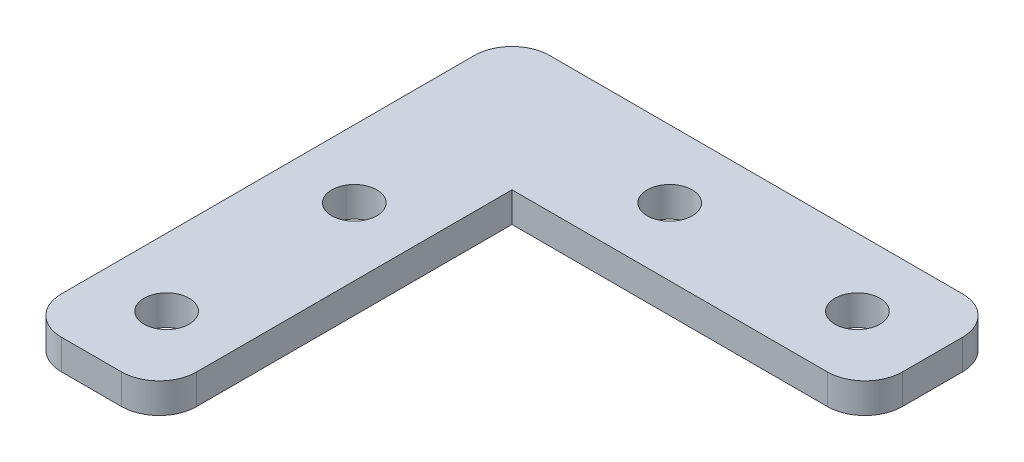
ISO-10303-21;
HEADER;
FILE_DESCRIPTION(('STEP AP214'),'2;1');
FILE_NAME('part.step','',(''),(''),'','','');
FILE_SCHEMA(('AUTOMOTIVE_DESIGN { 1 0 10303 214 1 1 1 1 }'));
ENDSEC;
DATA;
#1=APPLICATION_CONTEXT('core data for automotive mechanical design processes');
#2=APPLICATION_PROTOCOL_DEFINITION('international standard','automotive_design',2000,#1);
#3=PRODUCT_CONTEXT('',#1,'mechanical');
#4=PRODUCT('Part','Part','',(#3));
#5=PRODUCT_RELATED_PRODUCT_CATEGORY('part','',(#4));
#6=PRODUCT_DEFINITION_FORMATION('','',#4);
#7=PRODUCT_DEFINITION_CONTEXT('part definition',#1,'design');
#8=PRODUCT_DEFINITION('design','',#6,#7);
#9=PRODUCT_DEFINITION_SHAPE('','',#8);
#10=(LENGTH_UNIT() NAMED_UNIT(*) SI_UNIT(.MILLI.,.METRE.));
#11=(NAMED_UNIT(*) PLANE_ANGLE_UNIT() SI_UNIT($,.RADIAN.));
#12=(NAMED_UNIT(*) SI_UNIT($,.STERADIAN.) SOLID_ANGLE_UNIT());
#13=UNCERTAINTY_MEASURE_WITH_UNIT(LENGTH_MEASURE(1.E-05),#10,'distance_accuracy_value','');
#14=(GEOMETRIC_REPRESENTATION_CONTEXT(3) GLOBAL_UNCERTAINTY_ASSIGNED_CONTEXT((#13)) GLOBAL_UNIT_ASSIGNED_CONTEXT((#10,
#11,#12)) REPRESENTATION_CONTEXT('',''));
#15=CARTESIAN_POINT('',(0.,0.,0.));
#16=DIRECTION('',(0.,0.,1.));
#17=DIRECTION('',(1.,0.,0.));
#18=AXIS2_PLACEMENT_3D('',#15,#16,#17);
#19=CARTESIAN_POINT('',(0.,4.,0.));
#20=DIRECTION('',(0.,-1.,0.));
#21=DIRECTION('',(0.,0.,-1.));
#22=AXIS2_PLACEMENT_3D('',#19,#20,#21);
#23=PLANE('',#22);
#24=DIRECTION('',(-1.,0.,0.));
#25=VECTOR('',#24,1.);
#26=CARTESIAN_POINT('',(-32.5,4.,-32.5));
#27=LINE('',#26,#25);
#28=CARTESIAN_POINT('',(27.5,4.,-32.5));
#29=VERTEX_POINT('',#28);
#30=CARTESIAN_POINT('',(-27.5,4.,-32.5));
#31=VERTEX_POINT('',#30);
#32=EDGE_CURVE('E128',#29,#31,#27,.T.);
#33=ORIENTED_EDGE('',*,*,#32,.T.);
#34=CARTESIAN_POINT('',(-27.5,4.,-27.5));
#35=DIRECTION('',(0.,-1.,0.));
#36=DIRECTION('',(0.,0.,-1.));
#37=AXIS2_PLACEMENT_3D('',#34,#35,#36);
#38=CIRCLE('',#37,5.);
#39=CARTESIAN_POINT('',(-32.5,4.,-27.5));
#40=VERTEX_POINT('',#39);
#41=EDGE_CURVE('E175',#31,#40,#38,.F.);
#42=ORIENTED_EDGE('',*,*,#41,.T.);
#43=DIRECTION('',(0.,0.,1.));
#44=VECTOR('',#43,1.);
#45=CARTESIAN_POINT('',(-32.5,4.,32.5));
#46=LINE('',#45,#44);
#47=CARTESIAN_POINT('',(-32.5,4.,27.5));
#48=VERTEX_POINT('',#47);
#49=EDGE_CURVE('E121',#40,#48,#46,.T.);
#50=ORIENTED_EDGE('',*,*,#49,.T.);
#51=CARTESIAN_POINT('',(-27.5,4.,27.5));
#52=DIRECTION('',(0.,-1.,0.));
#53=DIRECTION('',(0.,0.,-1.));
#54=AXIS2_PLACEMENT_3D('',#51,#52,#53);
#55=CIRCLE('',#54,5.);
#56=CARTESIAN_POINT('',(-27.5,4.,32.5));
#57=VERTEX_POINT('',#56);
#58=EDGE_CURVE('E170',#48,#57,#55,.F.);
#59=ORIENTED_EDGE('',*,*,#58,.T.);
#60=DIRECTION('',(1.,0.,0.));
#61=VECTOR('',#60,1.);
#62=CARTESIAN_POINT('',(-14.5,4.,32.5));
#63=LINE('',#62,#61);
#64=CARTESIAN_POINT('',(-19.5,4.,32.5));
#65=VERTEX_POINT('',#64);
#66=EDGE_CURVE('E110',#57,#65,#63,.T.);
#67=ORIENTED_EDGE('',*,*,#66,.T.);
#68=CARTESIAN_POINT('',(-19.5,4.,27.5));
#69=DIRECTION('',(0.,-1.,0.));
#70=DIRECTION('',(0.,0.,-1.));
#71=AXIS2_PLACEMENT_3D('',#68,#69,#70);
#72=CIRCLE('',#71,5.);
#73=CARTESIAN_POINT('',(-14.5,4.,27.5));
#74=VERTEX_POINT('',#73);
#75=EDGE_CURVE('E107',#65,#74,#72,.F.);
#76=ORIENTED_EDGE('',*,*,#75,.T.);
#77=DIRECTION('',(0.,0.,-1.));
#78=VECTOR('',#77,1.);
#79=CARTESIAN_POINT('',(-14.5,4.,-14.5));
#80=LINE('',#79,#78);
#81=CARTESIAN_POINT('',(-14.5,4.,-14.5));
#82=VERTEX_POINT('',#81);
#83=EDGE_CURVE('E99',#74,#82,#80,.T.);
#84=ORIENTED_EDGE('',*,*,#83,.T.);
#85=DIRECTION('',(1.,0.,0.));
#86=VECTOR('',#85,1.);
#87=CARTESIAN_POINT('',(32.5,4.,-14.5));
#88=LINE('',#87,#86);
#89=CARTESIAN_POINT('',(27.5,4.,-14.5));
#90=VERTEX_POINT('',#89);
#91=EDGE_CURVE('E104',#82,#90,#88,.T.);
#92=ORIENTED_EDGE('',*,*,#91,.T.);
#93=CARTESIAN_POINT('',(27.5,4.,-19.5));
#94=DIRECTION('',(0.,-1.,0.));
#95=DIRECTION('',(0.,0.,-1.));
#96=AXIS2_PLACEMENT_3D('',#93,#94,#95);
#97=CIRCLE('',#96,5.);
#98=CARTESIAN_POINT('',(32.5,4.,-19.5));
#99=VERTEX_POINT('',#98);
#100=EDGE_CURVE('E38',#90,#99,#97,.F.);
#101=ORIENTED_EDGE('',*,*,#100,.T.);
#102=DIRECTION('',(0.,0.,-1.));
#103=VECTOR('',#102,1.);
#104=CARTESIAN_POINT('',(32.5,4.,-32.5));
#105=LINE('',#104,#103);
#106=CARTESIAN_POINT('',(32.5,4.,-27.5));
#107=VERTEX_POINT('',#106);
#108=EDGE_CURVE('E126',#99,#107,#105,.T.);
#109=ORIENTED_EDGE('',*,*,#108,.T.);
#110=CARTESIAN_POINT('',(27.5,4.,-27.5));
#111=DIRECTION('',(0.,-1.,0.));
#112=DIRECTION('',(0.,0.,-1.));
#113=AXIS2_PLACEMENT_3D('',#110,#111,#112);
#114=CIRCLE('',#113,5.);
#115=EDGE_CURVE('E173',#107,#29,#114,.F.);
#116=ORIENTED_EDGE('',*,*,#115,.T.);
#117=EDGE_LOOP('',(#33,#42,#50,#59,#67,#76,#84,#92,#101,#109,#116));
#118=FACE_BOUND('',#117,.T.);
#119=CARTESIAN_POINT('',(-23.5,4.,22.5));
#120=DIRECTION('',(0.,1.,0.));
#121=DIRECTION('',(0.,0.,1.));
#122=AXIS2_PLACEMENT_3D('',#119,#120,#121);
#123=CIRCLE('',#122,3.);
#124=CARTESIAN_POINT('',(-23.5,4.,25.5));
#125=VERTEX_POINT('',#124);
#126=EDGE_CURVE('E138',#125,#125,#123,.T.);
#127=ORIENTED_EDGE('',*,*,#126,.F.);
#128=EDGE_LOOP('',(#127));
#129=FACE_BOUND('',#128,.T.);
#130=CARTESIAN_POINT('',(-2.5,4.,-23.5));
#131=DIRECTION('',(0.,1.,0.));
#132=DIRECTION('',(0.,0.,1.));
#133=AXIS2_PLACEMENT_3D('',#130,#131,#132);
#134=CIRCLE('',#133,3.);
#135=CARTESIAN_POINT('',(-2.5,4.,-20.5));
#136=VERTEX_POINT('',#135);
#137=EDGE_CURVE('E201',#136,#136,#134,.T.);
#138=ORIENTED_EDGE('',*,*,#137,.F.);
#139=EDGE_LOOP('',(#138));
#140=FACE_BOUND('',#139,.T.);
#141=CARTESIAN_POINT('',(-23.5,4.,-2.5));
#142=DIRECTION('',(0.,1.,0.));
#143=DIRECTION('',(0.,0.,1.));
#144=AXIS2_PLACEMENT_3D('',#141,#142,#143);
#145=CIRCLE('',#144,2.99999999999999);
#146=CARTESIAN_POINT('',(-23.5,4.,0.499999999999992));
#147=VERTEX_POINT('',#146);
#148=EDGE_CURVE('E207',#147,#147,#145,.T.);
#149=ORIENTED_EDGE('',*,*,#148,.F.);
#150=EDGE_LOOP('',(#149));
#151=FACE_BOUND('',#150,.T.);
#152=CARTESIAN_POINT('',(22.5,4.,-23.5));
#153=DIRECTION('',(0.,1.,0.));
#154=DIRECTION('',(0.,0.,1.));
#155=AXIS2_PLACEMENT_3D('',#152,#153,#154);
#156=CIRCLE('',#155,3.);
#157=CARTESIAN_POINT('',(22.5,4.,-20.5));
#158=VERTEX_POINT('',#157);
#159=EDGE_CURVE('E213',#158,#158,#156,.T.);
#160=ORIENTED_EDGE('',*,*,#159,.F.);
#161=EDGE_LOOP('',(#160));
#162=FACE_BOUND('',#161,.T.);
#163=ADVANCED_FACE('F16',(#118,#129,#140,#151,#162),#23,.F.);
#164=CARTESIAN_POINT('',(0.,0.,0.));
#165=DIRECTION('',(0.,-1.,0.));
#166=DIRECTION('',(0.,0.,-1.));
#167=AXIS2_PLACEMENT_3D('',#164,#165,#166);
#168=PLANE('',#167);
#169=CARTESIAN_POINT('',(-23.5,0.,-2.5));
#170=DIRECTION('',(0.,1.,0.));
#171=DIRECTION('',(0.,0.,1.));
#172=AXIS2_PLACEMENT_3D('',#169,#170,#171);
#173=CIRCLE('',#172,2.99999999999999);
#174=CARTESIAN_POINT('',(-23.5,0.,0.499999999999992));
#175=VERTEX_POINT('',#174);
#176=EDGE_CURVE('E210',#175,#175,#173,.T.);
#177=ORIENTED_EDGE('',*,*,#176,.T.);
#178=EDGE_LOOP('',(#177));
#179=FACE_BOUND('',#178,.T.);
#180=CARTESIAN_POINT('',(-23.5,0.,22.5));
#181=DIRECTION('',(0.,1.,0.));
#182=DIRECTION('',(0.,0.,1.));
#183=AXIS2_PLACEMENT_3D('',#180,#181,#182);
#184=CIRCLE('',#183,3.);
#185=CARTESIAN_POINT('',(-23.5,0.,25.5));
#186=VERTEX_POINT('',#185);
#187=EDGE_CURVE('E198',#186,#186,#184,.T.);
#188=ORIENTED_EDGE('',*,*,#187,.T.);
#189=EDGE_LOOP('',(#188));
#190=FACE_BOUND('',#189,.T.);
#191=DIRECTION('',(0.,0.,1.));
#192=VECTOR('',#191,1.);
#193=CARTESIAN_POINT('',(-32.5,0.,32.5));
#194=LINE('',#193,#192);
#195=CARTESIAN_POINT('',(-32.5,0.,-27.5));
#196=VERTEX_POINT('',#195);
#197=CARTESIAN_POINT('',(-32.5,0.,27.5));
#198=VERTEX_POINT('',#197);
#199=EDGE_CURVE('E147',#196,#198,#194,.T.);
#200=ORIENTED_EDGE('',*,*,#199,.F.);
#201=CARTESIAN_POINT('',(-27.5,0.,-27.5));
#202=DIRECTION('',(0.,-1.,0.));
#203=DIRECTION('',(0.,0.,-1.));
#204=AXIS2_PLACEMENT_3D('',#201,#202,#203);
#205=CIRCLE('',#204,5.);
#206=CARTESIAN_POINT('',(-27.5,0.,-32.5));
#207=VERTEX_POINT('',#206);
#208=EDGE_CURVE('E162',#196,#207,#205,.T.);
#209=ORIENTED_EDGE('',*,*,#208,.T.);
#210=DIRECTION('',(-1.,0.,0.));
#211=VECTOR('',#210,1.);
#212=CARTESIAN_POINT('',(-32.5,0.,-32.5));
#213=LINE('',#212,#211);
#214=CARTESIAN_POINT('',(27.5,0.,-32.5));
#215=VERTEX_POINT('',#214);
#216=EDGE_CURVE('E144',#215,#207,#213,.T.);
#217=ORIENTED_EDGE('',*,*,#216,.F.);
#218=CARTESIAN_POINT('',(27.5,0.,-27.5));
#219=DIRECTION('',(0.,-1.,0.));
#220=DIRECTION('',(0.,0.,-1.));
#221=AXIS2_PLACEMENT_3D('',#218,#219,#220);
#222=CIRCLE('',#221,5.);
#223=CARTESIAN_POINT('',(32.5,0.,-27.5));
#224=VERTEX_POINT('',#223);
#225=EDGE_CURVE('E160',#215,#224,#222,.T.);
#226=ORIENTED_EDGE('',*,*,#225,.T.);
#227=DIRECTION('',(0.,0.,-1.));
#228=VECTOR('',#227,1.);
#229=CARTESIAN_POINT('',(32.5,0.,-32.5));
#230=LINE('',#229,#228);
#231=CARTESIAN_POINT('',(32.5,0.,-19.5));
#232=VERTEX_POINT('',#231);
#233=EDGE_CURVE('E142',#232,#224,#230,.T.);
#234=ORIENTED_EDGE('',*,*,#233,.F.);
#235=CARTESIAN_POINT('',(27.5,0.,-19.5));
#236=DIRECTION('',(0.,-1.,0.));
#237=DIRECTION('',(0.,0.,-1.));
#238=AXIS2_PLACEMENT_3D('',#235,#236,#237);
#239=CIRCLE('',#238,5.);
#240=CARTESIAN_POINT('',(27.5,0.,-14.5));
#241=VERTEX_POINT('',#240);
#242=EDGE_CURVE('E158',#232,#241,#239,.T.);
#243=ORIENTED_EDGE('',*,*,#242,.T.);
#244=DIRECTION('',(1.,0.,0.));
#245=VECTOR('',#244,1.);
#246=CARTESIAN_POINT('',(32.5,0.,-14.5));
#247=LINE('',#246,#245);
#248=CARTESIAN_POINT('',(-14.5,0.,-14.5));
#249=VERTEX_POINT('',#248);
#250=EDGE_CURVE('E140',#249,#241,#247,.T.);
#251=ORIENTED_EDGE('',*,*,#250,.F.);
#252=DIRECTION('',(0.,0.,-1.));
#253=VECTOR('',#252,1.);
#254=CARTESIAN_POINT('',(-14.5,0.,-14.5));
#255=LINE('',#254,#253);
#256=CARTESIAN_POINT('',(-14.5,0.,27.5));
#257=VERTEX_POINT('',#256);
#258=EDGE_CURVE('E116',#257,#249,#255,.T.);
#259=ORIENTED_EDGE('',*,*,#258,.F.);
#260=CARTESIAN_POINT('',(-19.5,0.,27.5));
#261=DIRECTION('',(0.,-1.,0.));
#262=DIRECTION('',(0.,0.,-1.));
#263=AXIS2_PLACEMENT_3D('',#260,#261,#262);
#264=CIRCLE('',#263,5.);
#265=CARTESIAN_POINT('',(-19.5,0.,32.5));
#266=VERTEX_POINT('',#265);
#267=EDGE_CURVE('E154',#257,#266,#264,.T.);
#268=ORIENTED_EDGE('',*,*,#267,.T.);
#269=DIRECTION('',(1.,0.,0.));
#270=VECTOR('',#269,1.);
#271=CARTESIAN_POINT('',(-14.5,0.,32.5));
#272=LINE('',#271,#270);
#273=CARTESIAN_POINT('',(-27.5,0.,32.5));
#274=VERTEX_POINT('',#273);
#275=EDGE_CURVE('E135',#274,#266,#272,.T.);
#276=ORIENTED_EDGE('',*,*,#275,.F.);
#277=CARTESIAN_POINT('',(-27.5,0.,27.5));
#278=DIRECTION('',(0.,-1.,0.));
#279=DIRECTION('',(0.,0.,-1.));
#280=AXIS2_PLACEMENT_3D('',#277,#278,#279);
#281=CIRCLE('',#280,5.);
#282=EDGE_CURVE('E156',#274,#198,#281,.T.);
#283=ORIENTED_EDGE('',*,*,#282,.T.);
#284=EDGE_LOOP('',(#200,#209,#217,#226,#234,#243,#251,#259,#268,#276,#283));
#285=FACE_BOUND('',#284,.T.);
#286=CARTESIAN_POINT('',(-2.5,0.,-23.5));
#287=DIRECTION('',(0.,1.,0.));
#288=DIRECTION('',(0.,0.,1.));
#289=AXIS2_PLACEMENT_3D('',#286,#287,#288);
#290=CIRCLE('',#289,3.);
#291=CARTESIAN_POINT('',(-2.5,0.,-20.5));
#292=VERTEX_POINT('',#291);
#293=EDGE_CURVE('E204',#292,#292,#290,.T.);
#294=ORIENTED_EDGE('',*,*,#293,.T.);
#295=EDGE_LOOP('',(#294));
#296=FACE_BOUND('',#295,.T.);
#297=CARTESIAN_POINT('',(22.5,0.,-23.5));
#298=DIRECTION('',(0.,1.,0.));
#299=DIRECTION('',(0.,0.,1.));
#300=AXIS2_PLACEMENT_3D('',#297,#298,#299);
#301=CIRCLE('',#300,3.);
#302=CARTESIAN_POINT('',(22.5,0.,-20.5));
#303=VERTEX_POINT('',#302);
#304=EDGE_CURVE('E216',#303,#303,#301,.T.);
#305=ORIENTED_EDGE('',*,*,#304,.T.);
#306=EDGE_LOOP('',(#305));
#307=FACE_BOUND('',#306,.T.);
#308=ADVANCED_FACE('F194',(#179,#190,#285,#296,#307),#168,.T.);
#309=CARTESIAN_POINT('',(-14.5,4.,32.5));
#310=DIRECTION('',(0.,0.,-1.));
#311=DIRECTION('',(-1.,0.,0.));
#312=AXIS2_PLACEMENT_3D('',#309,#310,#311);
#313=PLANE('',#312);
#314=ORIENTED_EDGE('',*,*,#66,.F.);
#315=DIRECTION('',(0.,-1.,0.));
#316=VECTOR('',#315,1.);
#317=CARTESIAN_POINT('',(-27.5,4.,32.5));
#318=LINE('',#317,#316);
#319=EDGE_CURVE('E24',#57,#274,#318,.T.);
#320=ORIENTED_EDGE('',*,*,#319,.T.);
#321=ORIENTED_EDGE('',*,*,#275,.T.);
#322=DIRECTION('',(0.,-1.,0.));
#323=VECTOR('',#322,1.);
#324=CARTESIAN_POINT('',(-19.5,4.,32.5));
#325=LINE('',#324,#323);
#326=EDGE_CURVE('E182',#266,#65,#325,.F.);
#327=ORIENTED_EDGE('',*,*,#326,.T.);
#328=EDGE_LOOP('',(#314,#320,#321,#327));
#329=FACE_BOUND('',#328,.T.);
#330=ADVANCED_FACE('F188',(#329),#313,.F.);
#331=CARTESIAN_POINT('',(-14.5,4.,-14.5));
#332=DIRECTION('',(-1.,0.,0.));
#333=DIRECTION('',(0.,0.,1.));
#334=AXIS2_PLACEMENT_3D('',#331,#332,#333);
#335=PLANE('',#334);
#336=ORIENTED_EDGE('',*,*,#83,.F.);
#337=DIRECTION('',(0.,-1.,0.));
#338=VECTOR('',#337,1.);
#339=CARTESIAN_POINT('',(-14.5,4.,27.5));
#340=LINE('',#339,#338);
#341=EDGE_CURVE('E10',#74,#257,#340,.T.);
#342=ORIENTED_EDGE('',*,*,#341,.T.);
#343=ORIENTED_EDGE('',*,*,#258,.T.);
#344=DIRECTION('',(0.,-1.,0.));
#345=VECTOR('',#344,1.);
#346=CARTESIAN_POINT('',(-14.5,4.,-14.5));
#347=LINE('',#346,#345);
#348=EDGE_CURVE('E113',#82,#249,#347,.T.);
#349=ORIENTED_EDGE('',*,*,#348,.F.);
#350=EDGE_LOOP('',(#336,#342,#343,#349));
#351=FACE_BOUND('',#350,.T.);
#352=ADVANCED_FACE('F114',(#351),#335,.F.);
#353=CARTESIAN_POINT('',(32.5,4.,-14.5));
#354=DIRECTION('',(0.,0.,-1.));
#355=DIRECTION('',(-1.,0.,0.));
#356=AXIS2_PLACEMENT_3D('',#353,#354,#355);
#357=PLANE('',#356);
#358=ORIENTED_EDGE('',*,*,#250,.T.);
#359=DIRECTION('',(0.,-1.,0.));
#360=VECTOR('',#359,1.);
#361=CARTESIAN_POINT('',(27.5,4.,-14.5));
#362=LINE('',#361,#360);
#363=EDGE_CURVE('E125',#241,#90,#362,.F.);
#364=ORIENTED_EDGE('',*,*,#363,.T.);
#365=ORIENTED_EDGE('',*,*,#91,.F.);
#366=ORIENTED_EDGE('',*,*,#348,.T.);
#367=EDGE_LOOP('',(#358,#364,#365,#366));
#368=FACE_BOUND('',#367,.T.);
#369=ADVANCED_FACE('F123',(#368),#357,.F.);
#370=CARTESIAN_POINT('',(32.5,4.,-32.5));
#371=DIRECTION('',(-1.,0.,0.));
#372=DIRECTION('',(0.,0.,1.));
#373=AXIS2_PLACEMENT_3D('',#370,#371,#372);
#374=PLANE('',#373);
#375=ORIENTED_EDGE('',*,*,#233,.T.);
#376=DIRECTION('',(0.,-1.,0.));
#377=VECTOR('',#376,1.);
#378=CARTESIAN_POINT('',(32.5,4.,-27.5));
#379=LINE('',#378,#377);
#380=EDGE_CURVE('E31',#224,#107,#379,.F.);
#381=ORIENTED_EDGE('',*,*,#380,.T.);
#382=ORIENTED_EDGE('',*,*,#108,.F.);
#383=DIRECTION('',(0.,-1.,0.));
#384=VECTOR('',#383,1.);
#385=CARTESIAN_POINT('',(32.5,4.,-19.5));
#386=LINE('',#385,#384);
#387=EDGE_CURVE('E177',#99,#232,#386,.T.);
#388=ORIENTED_EDGE('',*,*,#387,.T.);
#389=EDGE_LOOP('',(#375,#381,#382,#388));
#390=FACE_BOUND('',#389,.T.);
#391=ADVANCED_FACE('F244',(#390),#374,.F.);
#392=CARTESIAN_POINT('',(-32.5,4.,-32.5));
#393=DIRECTION('',(0.,0.,1.));
#394=DIRECTION('',(1.,0.,0.));
#395=AXIS2_PLACEMENT_3D('',#392,#393,#394);
#396=PLANE('',#395);
#397=ORIENTED_EDGE('',*,*,#216,.T.);
#398=DIRECTION('',(0.,-1.,0.));
#399=VECTOR('',#398,1.);
#400=CARTESIAN_POINT('',(-27.5,4.,-32.5));
#401=LINE('',#400,#399);
#402=EDGE_CURVE('E167',#207,#31,#401,.F.);
#403=ORIENTED_EDGE('',*,*,#402,.T.);
#404=ORIENTED_EDGE('',*,*,#32,.F.);
#405=DIRECTION('',(0.,-1.,0.));
#406=VECTOR('',#405,1.);
#407=CARTESIAN_POINT('',(27.5,4.,-32.5));
#408=LINE('',#407,#406);
#409=EDGE_CURVE('E164',#29,#215,#408,.T.);
#410=ORIENTED_EDGE('',*,*,#409,.T.);
#411=EDGE_LOOP('',(#397,#403,#404,#410));
#412=FACE_BOUND('',#411,.T.);
#413=ADVANCED_FACE('F240',(#412),#396,.F.);
#414=CARTESIAN_POINT('',(-32.5,4.,32.5));
#415=DIRECTION('',(1.,0.,0.));
#416=DIRECTION('',(0.,0.,-1.));
#417=AXIS2_PLACEMENT_3D('',#414,#415,#416);
#418=PLANE('',#417);
#419=ORIENTED_EDGE('',*,*,#49,.F.);
#420=DIRECTION('',(0.,-1.,0.));
#421=VECTOR('',#420,1.);
#422=CARTESIAN_POINT('',(-32.5,4.,-27.5));
#423=LINE('',#422,#421);
#424=EDGE_CURVE('E151',#40,#196,#423,.T.);
#425=ORIENTED_EDGE('',*,*,#424,.T.);
#426=ORIENTED_EDGE('',*,*,#199,.T.);
#427=DIRECTION('',(0.,-1.,0.));
#428=VECTOR('',#427,1.);
#429=CARTESIAN_POINT('',(-32.5,4.,27.5));
#430=LINE('',#429,#428);
#431=EDGE_CURVE('E120',#198,#48,#430,.F.);
#432=ORIENTED_EDGE('',*,*,#431,.T.);
#433=EDGE_LOOP('',(#419,#425,#426,#432));
#434=FACE_BOUND('',#433,.T.);
#435=ADVANCED_FACE('F237',(#434),#418,.F.);
#436=CARTESIAN_POINT('',(-23.5,4.,22.5));
#437=DIRECTION('',(0.,-1.,0.));
#438=DIRECTION('',(0.,0.,-1.));
#439=AXIS2_PLACEMENT_3D('',#436,#437,#438);
#440=CYLINDRICAL_SURFACE('',#439,3.);
#441=ORIENTED_EDGE('',*,*,#126,.T.);
#442=EDGE_LOOP('',(#441));
#443=FACE_BOUND('',#442,.T.);
#444=ORIENTED_EDGE('',*,*,#187,.F.);
#445=EDGE_LOOP('',(#444));
#446=FACE_BOUND('',#445,.T.);
#447=ADVANCED_FACE('F234',(#443,#446),#440,.F.);
#448=CARTESIAN_POINT('',(-2.5,4.,-23.5));
#449=DIRECTION('',(0.,-1.,0.));
#450=DIRECTION('',(0.,0.,-1.));
#451=AXIS2_PLACEMENT_3D('',#448,#449,#450);
#452=CYLINDRICAL_SURFACE('',#451,3.);
#453=ORIENTED_EDGE('',*,*,#137,.T.);
#454=EDGE_LOOP('',(#453));
#455=FACE_BOUND('',#454,.T.);
#456=ORIENTED_EDGE('',*,*,#293,.F.);
#457=EDGE_LOOP('',(#456));
#458=FACE_BOUND('',#457,.T.);
#459=ADVANCED_FACE('F333',(#455,#458),#452,.F.);
#460=CARTESIAN_POINT('',(-23.5,4.,-2.5));
#461=DIRECTION('',(0.,-1.,0.));
#462=DIRECTION('',(0.,0.,-1.));
#463=AXIS2_PLACEMENT_3D('',#460,#461,#462);
#464=CYLINDRICAL_SURFACE('',#463,2.99999999999999);
#465=ORIENTED_EDGE('',*,*,#148,.T.);
#466=EDGE_LOOP('',(#465));
#467=FACE_BOUND('',#466,.T.);
#468=ORIENTED_EDGE('',*,*,#176,.F.);
#469=EDGE_LOOP('',(#468));
#470=FACE_BOUND('',#469,.T.);
#471=ADVANCED_FACE('F322',(#467,#470),#464,.F.);
#472=CARTESIAN_POINT('',(22.5,4.,-23.5));
#473=DIRECTION('',(0.,-1.,0.));
#474=DIRECTION('',(0.,0.,-1.));
#475=AXIS2_PLACEMENT_3D('',#472,#473,#474);
#476=CYLINDRICAL_SURFACE('',#475,3.);
#477=ORIENTED_EDGE('',*,*,#159,.T.);
#478=EDGE_LOOP('',(#477));
#479=FACE_BOUND('',#478,.T.);
#480=ORIENTED_EDGE('',*,*,#304,.F.);
#481=EDGE_LOOP('',(#480));
#482=FACE_BOUND('',#481,.T.);
#483=ADVANCED_FACE('F222',(#479,#482),#476,.F.);
#484=CARTESIAN_POINT('',(-27.5,4.,-27.5));
#485=DIRECTION('',(0.,-1.,0.));
#486=DIRECTION('',(0.,0.,-1.));
#487=AXIS2_PLACEMENT_3D('',#484,#485,#486);
#488=CYLINDRICAL_SURFACE('',#487,5.);
#489=ORIENTED_EDGE('',*,*,#41,.F.);
#490=ORIENTED_EDGE('',*,*,#402,.F.);
#491=ORIENTED_EDGE('',*,*,#208,.F.);
#492=ORIENTED_EDGE('',*,*,#424,.F.);
#493=EDGE_LOOP('',(#489,#490,#491,#492));
#494=FACE_BOUND('',#493,.T.);
#495=ADVANCED_FACE('F254',(#494),#488,.T.);
#496=CARTESIAN_POINT('',(27.5,4.,-27.5));
#497=DIRECTION('',(0.,-1.,0.));
#498=DIRECTION('',(0.,0.,-1.));
#499=AXIS2_PLACEMENT_3D('',#496,#497,#498);
#500=CYLINDRICAL_SURFACE('',#499,5.);
#501=ORIENTED_EDGE('',*,*,#115,.F.);
#502=ORIENTED_EDGE('',*,*,#380,.F.);
#503=ORIENTED_EDGE('',*,*,#225,.F.);
#504=ORIENTED_EDGE('',*,*,#409,.F.);
#505=EDGE_LOOP('',(#501,#502,#503,#504));
#506=FACE_BOUND('',#505,.T.);
#507=ADVANCED_FACE('F257',(#506),#500,.T.);
#508=CARTESIAN_POINT('',(27.5,4.,-19.5));
#509=DIRECTION('',(0.,-1.,0.));
#510=DIRECTION('',(0.,0.,-1.));
#511=AXIS2_PLACEMENT_3D('',#508,#509,#510);
#512=CYLINDRICAL_SURFACE('',#511,5.);
#513=ORIENTED_EDGE('',*,*,#100,.F.);
#514=ORIENTED_EDGE('',*,*,#363,.F.);
#515=ORIENTED_EDGE('',*,*,#242,.F.);
#516=ORIENTED_EDGE('',*,*,#387,.F.);
#517=EDGE_LOOP('',(#513,#514,#515,#516));
#518=FACE_BOUND('',#517,.T.);
#519=ADVANCED_FACE('F261',(#518),#512,.T.);
#520=CARTESIAN_POINT('',(-27.5,4.,27.5));
#521=DIRECTION('',(0.,-1.,0.));
#522=DIRECTION('',(0.,0.,-1.));
#523=AXIS2_PLACEMENT_3D('',#520,#521,#522);
#524=CYLINDRICAL_SURFACE('',#523,5.);
#525=ORIENTED_EDGE('',*,*,#58,.F.);
#526=ORIENTED_EDGE('',*,*,#431,.F.);
#527=ORIENTED_EDGE('',*,*,#282,.F.);
#528=ORIENTED_EDGE('',*,*,#319,.F.);
#529=EDGE_LOOP('',(#525,#526,#527,#528));
#530=FACE_BOUND('',#529,.T.);
#531=ADVANCED_FACE('F264',(#530),#524,.T.);
#532=CARTESIAN_POINT('',(-19.5,4.,27.5));
#533=DIRECTION('',(0.,-1.,0.));
#534=DIRECTION('',(0.,0.,-1.));
#535=AXIS2_PLACEMENT_3D('',#532,#533,#534);
#536=CYLINDRICAL_SURFACE('',#535,5.);
#537=ORIENTED_EDGE('',*,*,#75,.F.);
#538=ORIENTED_EDGE('',*,*,#326,.F.);
#539=ORIENTED_EDGE('',*,*,#267,.F.);
#540=ORIENTED_EDGE('',*,*,#341,.F.);
#541=EDGE_LOOP('',(#537,#538,#539,#540));
#542=FACE_BOUND('',#541,.T.);
#543=ADVANCED_FACE('F18',(#542),#536,.T.);
#544=CLOSED_SHELL('',(#163,#308,#330,#352,#369,#391,#413,#435,#447,#459,#471,#483,#495,#507,
#519,#531,#543));
#545=MANIFOLD_SOLID_BREP('B1',#544);
#546=ADVANCED_BREP_SHAPE_REPRESENTATION('',(#18,#545),#14);
#547=SHAPE_DEFINITION_REPRESENTATION(#9,#546);
ENDSEC;
END-ISO-10303-21;
